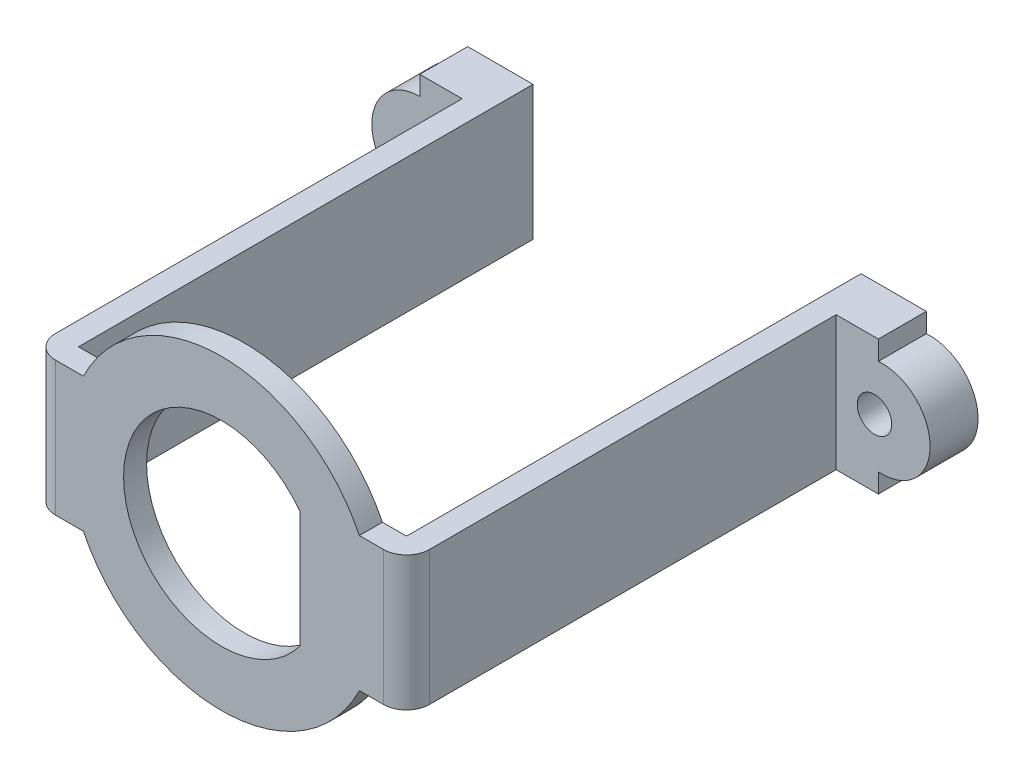
ISO-10303-21;
HEADER;
FILE_DESCRIPTION(('STEP AP214'),'2;1');
FILE_NAME('part.step','',(''),(''),'','','');
FILE_SCHEMA(('AUTOMOTIVE_DESIGN { 1 0 10303 214 1 1 1 1 }'));
ENDSEC;
DATA;
#1=APPLICATION_CONTEXT('core data for automotive mechanical design processes');
#2=APPLICATION_PROTOCOL_DEFINITION('international standard','automotive_design',2000,#1);
#3=PRODUCT_CONTEXT('',#1,'mechanical');
#4=PRODUCT('Part','Part','',(#3));
#5=PRODUCT_RELATED_PRODUCT_CATEGORY('part','',(#4));
#6=PRODUCT_DEFINITION_FORMATION('','',#4);
#7=PRODUCT_DEFINITION_CONTEXT('part definition',#1,'design');
#8=PRODUCT_DEFINITION('design','',#6,#7);
#9=PRODUCT_DEFINITION_SHAPE('','',#8);
#10=(LENGTH_UNIT() NAMED_UNIT(*) SI_UNIT(.MILLI.,.METRE.));
#11=(NAMED_UNIT(*) PLANE_ANGLE_UNIT() SI_UNIT($,.RADIAN.));
#12=(NAMED_UNIT(*) SI_UNIT($,.STERADIAN.) SOLID_ANGLE_UNIT());
#13=UNCERTAINTY_MEASURE_WITH_UNIT(LENGTH_MEASURE(1.E-05),#10,'distance_accuracy_value','');
#14=(GEOMETRIC_REPRESENTATION_CONTEXT(3) GLOBAL_UNCERTAINTY_ASSIGNED_CONTEXT((#13)) GLOBAL_UNIT_ASSIGNED_CONTEXT((#10,
#11,#12)) REPRESENTATION_CONTEXT('',''));
#15=CARTESIAN_POINT('',(0.,0.,0.));
#16=DIRECTION('',(0.,0.,1.));
#17=DIRECTION('',(1.,0.,0.));
#18=AXIS2_PLACEMENT_3D('',#15,#16,#17);
#19=CARTESIAN_POINT('',(11.8500000000001,-2.49198715887542,-21.2000000000001));
#20=DIRECTION('',(1.,0.,0.));
#21=DIRECTION('',(0.,0.,-1.));
#22=AXIS2_PLACEMENT_3D('',#19,#20,#21);
#23=PLANE('',#22);
#24=DIRECTION('',(0.,1.,0.));
#25=VECTOR('',#24,1.);
#26=CARTESIAN_POINT('',(11.8500000000001,0.,-21.2000000000001));
#27=LINE('',#26,#25);
#28=CARTESIAN_POINT('',(11.8500000000001,-2.49198715887542,-21.2000000000001));
#29=VERTEX_POINT('',#28);
#30=CARTESIAN_POINT('',(11.8500000000001,-3.5,-21.2000000000001));
#31=VERTEX_POINT('',#30);
#32=EDGE_CURVE('E181',#29,#31,#27,.F.);
#33=ORIENTED_EDGE('',*,*,#32,.T.);
#34=DIRECTION('',(0.,0.,1.));
#35=VECTOR('',#34,1.);
#36=CARTESIAN_POINT('',(11.8500000000001,-3.5,-23.7));
#37=LINE('',#36,#35);
#38=CARTESIAN_POINT('',(11.8500000000001,-3.5,-23.7));
#39=VERTEX_POINT('',#38);
#40=EDGE_CURVE('E214',#31,#39,#37,.F.);
#41=ORIENTED_EDGE('',*,*,#40,.T.);
#42=DIRECTION('',(0.,1.,0.));
#43=VECTOR('',#42,1.);
#44=CARTESIAN_POINT('',(11.8500000000001,-2.49198715887542,-23.7000000000001));
#45=LINE('',#44,#43);
#46=CARTESIAN_POINT('',(11.8500000000001,-2.49198715887542,-23.7000000000001));
#47=VERTEX_POINT('',#46);
#48=EDGE_CURVE('E183',#39,#47,#45,.T.);
#49=ORIENTED_EDGE('',*,*,#48,.T.);
#50=DIRECTION('',(0.,0.,-1.));
#51=VECTOR('',#50,1.);
#52=CARTESIAN_POINT('',(11.8500000000001,-2.49198715887542,-21.2000000000001));
#53=LINE('',#52,#51);
#54=EDGE_CURVE('E178',#29,#47,#53,.T.);
#55=ORIENTED_EDGE('',*,*,#54,.F.);
#56=EDGE_LOOP('',(#33,#41,#49,#55));
#57=FACE_BOUND('',#56,.T.);
#58=ADVANCED_FACE('F16',(#57),#23,.T.);
#59=CARTESIAN_POINT('',(11.6500000000001,0.,1.20100000000001));
#60=DIRECTION('',(0.,0.,-1.));
#61=DIRECTION('',(-1.,0.,0.));
#62=AXIS2_PLACEMENT_3D('',#59,#60,#61);
#63=CYLINDRICAL_SURFACE('',#62,0.900000000000128);
#64=CARTESIAN_POINT('',(11.6500000000001,0.,-21.2000000000001));
#65=DIRECTION('',(0.,0.,-1.));
#66=DIRECTION('',(-1.,0.,0.));
#67=AXIS2_PLACEMENT_3D('',#64,#65,#66);
#68=CIRCLE('',#67,0.900000000000128);
#69=CARTESIAN_POINT('',(10.7499999999999,0.,-21.2000000000001));
#70=VERTEX_POINT('',#69);
#71=EDGE_CURVE('E19',#70,#70,#68,.F.);
#72=ORIENTED_EDGE('',*,*,#71,.T.);
#73=EDGE_LOOP('',(#72));
#74=FACE_BOUND('',#73,.T.);
#75=CARTESIAN_POINT('',(11.65,0.,-23.7000000000001));
#76=DIRECTION('',(0.,0.,-1.));
#77=DIRECTION('',(-1.,0.,0.));
#78=AXIS2_PLACEMENT_3D('',#75,#76,#77);
#79=CIRCLE('',#78,0.900000000000128);
#80=CARTESIAN_POINT('',(10.7499999999999,0.,-23.7000000000001));
#81=VERTEX_POINT('',#80);
#82=EDGE_CURVE('E210',#81,#81,#79,.T.);
#83=ORIENTED_EDGE('',*,*,#82,.T.);
#84=EDGE_LOOP('',(#83));
#85=FACE_BOUND('',#84,.T.);
#86=ADVANCED_FACE('F734',(#74,#85),#63,.F.);
#87=CARTESIAN_POINT('',(12.0500000000001,0.,-21.2000000000001));
#88=DIRECTION('',(0.,0.,-1.));
#89=DIRECTION('',(-1.,0.,0.));
#90=AXIS2_PLACEMENT_3D('',#87,#88,#89);
#91=CYLINDRICAL_SURFACE('',#90,2.5);
#92=CARTESIAN_POINT('',(12.0500000000001,0.,-21.2000000000001));
#93=DIRECTION('',(0.,0.,-1.));
#94=DIRECTION('',(-1.,0.,0.));
#95=AXIS2_PLACEMENT_3D('',#92,#93,#94);
#96=CIRCLE('',#95,2.5);
#97=CARTESIAN_POINT('',(11.8500000000001,2.49198715887542,-21.2000000000001));
#98=VERTEX_POINT('',#97);
#99=EDGE_CURVE('E190',#98,#29,#96,.T.);
#100=ORIENTED_EDGE('',*,*,#99,.T.);
#101=ORIENTED_EDGE('',*,*,#54,.T.);
#102=CARTESIAN_POINT('',(12.0500000000001,0.,-23.7000000000001));
#103=DIRECTION('',(0.,0.,-1.));
#104=DIRECTION('',(-1.,0.,0.));
#105=AXIS2_PLACEMENT_3D('',#102,#103,#104);
#106=CIRCLE('',#105,2.5);
#107=CARTESIAN_POINT('',(11.8500000000001,2.49198715887542,-23.7));
#108=VERTEX_POINT('',#107);
#109=EDGE_CURVE('E215',#47,#108,#106,.F.);
#110=ORIENTED_EDGE('',*,*,#109,.T.);
#111=DIRECTION('',(0.,0.,-1.));
#112=VECTOR('',#111,1.);
#113=CARTESIAN_POINT('',(11.8500000000001,2.49198715887542,-21.2000000000001));
#114=LINE('',#113,#112);
#115=EDGE_CURVE('E173',#98,#108,#114,.T.);
#116=ORIENTED_EDGE('',*,*,#115,.F.);
#117=EDGE_LOOP('',(#100,#101,#110,#116));
#118=FACE_BOUND('',#117,.T.);
#119=ADVANCED_FACE('F196',(#118),#91,.T.);
#120=CARTESIAN_POINT('',(11.8500000000001,3.5,-21.2000000000001));
#121=DIRECTION('',(1.,0.,0.));
#122=DIRECTION('',(0.,0.,-1.));
#123=AXIS2_PLACEMENT_3D('',#120,#121,#122);
#124=PLANE('',#123);
#125=DIRECTION('',(0.,1.,0.));
#126=VECTOR('',#125,1.);
#127=CARTESIAN_POINT('',(11.8500000000001,0.,-21.2000000000001));
#128=LINE('',#127,#126);
#129=CARTESIAN_POINT('',(11.8500000000001,3.5,-21.2000000000001));
#130=VERTEX_POINT('',#129);
#131=EDGE_CURVE('E197',#130,#98,#128,.F.);
#132=ORIENTED_EDGE('',*,*,#131,.T.);
#133=ORIENTED_EDGE('',*,*,#115,.T.);
#134=DIRECTION('',(0.,1.,0.));
#135=VECTOR('',#134,1.);
#136=CARTESIAN_POINT('',(11.8500000000001,3.5,-23.7));
#137=LINE('',#136,#135);
#138=CARTESIAN_POINT('',(11.8500000000001,3.5,-23.7));
#139=VERTEX_POINT('',#138);
#140=EDGE_CURVE('E217',#108,#139,#137,.T.);
#141=ORIENTED_EDGE('',*,*,#140,.T.);
#142=DIRECTION('',(0.,0.,-1.));
#143=VECTOR('',#142,1.);
#144=CARTESIAN_POINT('',(11.8500000000001,3.5,0.));
#145=LINE('',#144,#143);
#146=EDGE_CURVE('E269',#139,#130,#145,.F.);
#147=ORIENTED_EDGE('',*,*,#146,.T.);
#148=EDGE_LOOP('',(#132,#133,#141,#147));
#149=FACE_BOUND('',#148,.T.);
#150=ADVANCED_FACE('F718',(#149),#124,.T.);
#151=CARTESIAN_POINT('',(12.0500000000001,0.,-21.2000000000001));
#152=DIRECTION('',(0.,0.,-1.));
#153=DIRECTION('',(-1.,0.,0.));
#154=AXIS2_PLACEMENT_3D('',#151,#152,#153);
#155=PLANE('',#154);
#156=DIRECTION('',(1.,0.,0.));
#157=VECTOR('',#156,1.);
#158=CARTESIAN_POINT('',(9.65000000000008,-3.5,-21.2000000000001));
#159=LINE('',#158,#157);
#160=CARTESIAN_POINT('',(9.65000000000003,-3.5,-21.2000000000001));
#161=VERTEX_POINT('',#160);
#162=EDGE_CURVE('E193',#161,#31,#159,.T.);
#163=ORIENTED_EDGE('',*,*,#162,.T.);
#164=ORIENTED_EDGE('',*,*,#32,.F.);
#165=ORIENTED_EDGE('',*,*,#99,.F.);
#166=ORIENTED_EDGE('',*,*,#131,.F.);
#167=DIRECTION('',(1.,0.,0.));
#168=VECTOR('',#167,1.);
#169=CARTESIAN_POINT('',(9.65,3.5,-21.2000000000001));
#170=LINE('',#169,#168);
#171=CARTESIAN_POINT('',(9.65000000000007,3.5,-21.2000000000001));
#172=VERTEX_POINT('',#171);
#173=EDGE_CURVE('E265',#130,#172,#170,.F.);
#174=ORIENTED_EDGE('',*,*,#173,.T.);
#175=DIRECTION('',(0.,1.,0.));
#176=VECTOR('',#175,1.);
#177=CARTESIAN_POINT('',(9.65000000000007,-3.5,-21.2000000000001));
#178=LINE('',#177,#176);
#179=EDGE_CURVE('E194',#161,#172,#178,.T.);
#180=ORIENTED_EDGE('',*,*,#179,.F.);
#181=EDGE_LOOP('',(#163,#164,#165,#166,#174,#180));
#182=FACE_BOUND('',#181,.T.);
#183=ORIENTED_EDGE('',*,*,#71,.F.);
#184=EDGE_LOOP('',(#183));
#185=FACE_BOUND('',#184,.T.);
#186=ADVANCED_FACE('F188',(#182,#185),#155,.F.);
#187=CARTESIAN_POINT('',(9.65,-3.5,0.));
#188=DIRECTION('',(1.,0.,0.));
#189=DIRECTION('',(0.,0.,-1.));
#190=AXIS2_PLACEMENT_3D('',#187,#188,#189);
#191=PLANE('',#190);
#192=DIRECTION('',(0.,0.,-1.));
#193=VECTOR('',#192,1.);
#194=CARTESIAN_POINT('',(9.65000000000007,3.5,0.));
#195=LINE('',#194,#193);
#196=CARTESIAN_POINT('',(9.65000000000004,3.5,0.));
#197=VERTEX_POINT('',#196);
#198=EDGE_CURVE('E268',#172,#197,#195,.F.);
#199=ORIENTED_EDGE('',*,*,#198,.T.);
#200=DIRECTION('',(0.,1.,0.));
#201=VECTOR('',#200,1.);
#202=CARTESIAN_POINT('',(9.65,3.5,0.));
#203=LINE('',#202,#201);
#204=CARTESIAN_POINT('',(9.65,-3.5,0.));
#205=VERTEX_POINT('',#204);
#206=EDGE_CURVE('E204',#205,#197,#203,.T.);
#207=ORIENTED_EDGE('',*,*,#206,.F.);
#208=DIRECTION('',(0.,0.,1.));
#209=VECTOR('',#208,1.);
#210=CARTESIAN_POINT('',(9.65,-3.5,-23.7));
#211=LINE('',#210,#209);
#212=EDGE_CURVE('E209',#205,#161,#211,.F.);
#213=ORIENTED_EDGE('',*,*,#212,.T.);
#214=ORIENTED_EDGE('',*,*,#179,.T.);
#215=EDGE_LOOP('',(#199,#207,#213,#214));
#216=FACE_BOUND('',#215,.T.);
#217=ADVANCED_FACE('F701',(#216),#191,.T.);
#218=CARTESIAN_POINT('',(8.45,3.5,0.));
#219=DIRECTION('',(0.,1.,0.));
#220=DIRECTION('',(0.,0.,1.));
#221=AXIS2_PLACEMENT_3D('',#218,#219,#220);
#222=CYLINDRICAL_SURFACE('',#221,1.2);
#223=CARTESIAN_POINT('',(8.45,-3.5,0.));
#224=DIRECTION('',(0.,1.,0.));
#225=DIRECTION('',(0.,0.,1.));
#226=AXIS2_PLACEMENT_3D('',#223,#224,#225);
#227=CIRCLE('',#226,1.2);
#228=CARTESIAN_POINT('',(8.45,-3.5,1.2));
#229=VERTEX_POINT('',#228);
#230=EDGE_CURVE('E202',#229,#205,#227,.T.);
#231=ORIENTED_EDGE('',*,*,#230,.T.);
#232=ORIENTED_EDGE('',*,*,#206,.T.);
#233=CARTESIAN_POINT('',(8.45,3.5,0.));
#234=DIRECTION('',(0.,1.,0.));
#235=DIRECTION('',(0.,0.,1.));
#236=AXIS2_PLACEMENT_3D('',#233,#234,#235);
#237=CIRCLE('',#236,1.2);
#238=CARTESIAN_POINT('',(8.45,3.5,1.2));
#239=VERTEX_POINT('',#238);
#240=EDGE_CURVE('E200',#197,#239,#237,.F.);
#241=ORIENTED_EDGE('',*,*,#240,.T.);
#242=DIRECTION('',(0.,1.,0.));
#243=VECTOR('',#242,1.);
#244=CARTESIAN_POINT('',(8.44999999999999,0.,1.2));
#245=LINE('',#244,#243);
#246=EDGE_CURVE('E274',#229,#239,#245,.T.);
#247=ORIENTED_EDGE('',*,*,#246,.F.);
#248=EDGE_LOOP('',(#231,#232,#241,#247));
#249=FACE_BOUND('',#248,.T.);
#250=ADVANCED_FACE('F693',(#249),#222,.T.);
#251=CARTESIAN_POINT('',(-8.65,-3.5,0.));
#252=DIRECTION('',(0.,-1.,0.));
#253=DIRECTION('',(1.,0.,0.));
#254=AXIS2_PLACEMENT_3D('',#251,#252,#253);
#255=CYLINDRICAL_SURFACE('',#254,1.2);
#256=CARTESIAN_POINT('',(-8.65,3.5,0.));
#257=DIRECTION('',(0.,-1.,0.));
#258=DIRECTION('',(1.,0.,0.));
#259=AXIS2_PLACEMENT_3D('',#256,#257,#258);
#260=CIRCLE('',#259,1.2);
#261=CARTESIAN_POINT('',(-8.65,3.5,1.2));
#262=VERTEX_POINT('',#261);
#263=CARTESIAN_POINT('',(-9.85,3.5,0.));
#264=VERTEX_POINT('',#263);
#265=EDGE_CURVE('E207',#262,#264,#260,.T.);
#266=ORIENTED_EDGE('',*,*,#265,.T.);
#267=DIRECTION('',(0.,1.,0.));
#268=VECTOR('',#267,1.);
#269=CARTESIAN_POINT('',(-9.85,3.5,0.));
#270=LINE('',#269,#268);
#271=CARTESIAN_POINT('',(-9.85000000000003,-3.5,0.));
#272=VERTEX_POINT('',#271);
#273=EDGE_CURVE('E284',#272,#264,#270,.T.);
#274=ORIENTED_EDGE('',*,*,#273,.F.);
#275=CARTESIAN_POINT('',(-8.65,-3.5,0.));
#276=DIRECTION('',(0.,-1.,0.));
#277=DIRECTION('',(1.,0.,0.));
#278=AXIS2_PLACEMENT_3D('',#275,#276,#277);
#279=CIRCLE('',#278,1.2);
#280=CARTESIAN_POINT('',(-8.65,-3.5,1.2));
#281=VERTEX_POINT('',#280);
#282=EDGE_CURVE('E205',#272,#281,#279,.F.);
#283=ORIENTED_EDGE('',*,*,#282,.T.);
#284=DIRECTION('',(0.,1.,0.));
#285=VECTOR('',#284,1.);
#286=CARTESIAN_POINT('',(-8.64999999999999,0.,1.2));
#287=LINE('',#286,#285);
#288=EDGE_CURVE('E324',#262,#281,#287,.F.);
#289=ORIENTED_EDGE('',*,*,#288,.F.);
#290=EDGE_LOOP('',(#266,#274,#283,#289));
#291=FACE_BOUND('',#290,.T.);
#292=ADVANCED_FACE('F493',(#291),#255,.T.);
#293=CARTESIAN_POINT('',(9.65000000000008,3.5,-23.7));
#294=DIRECTION('',(0.,0.,1.));
#295=DIRECTION('',(1.,0.,0.));
#296=AXIS2_PLACEMENT_3D('',#293,#294,#295);
#297=PLANE('',#296);
#298=DIRECTION('',(1.,0.,0.));
#299=VECTOR('',#298,1.);
#300=CARTESIAN_POINT('',(9.65,3.5,-23.7));
#301=LINE('',#300,#299);
#302=CARTESIAN_POINT('',(8.45000000000008,3.5,-23.7));
#303=VERTEX_POINT('',#302);
#304=EDGE_CURVE('E309',#303,#139,#301,.T.);
#305=ORIENTED_EDGE('',*,*,#304,.T.);
#306=ORIENTED_EDGE('',*,*,#140,.F.);
#307=ORIENTED_EDGE('',*,*,#109,.F.);
#308=ORIENTED_EDGE('',*,*,#48,.F.);
#309=DIRECTION('',(1.,0.,0.));
#310=VECTOR('',#309,1.);
#311=CARTESIAN_POINT('',(9.65000000000008,-3.5,-23.7));
#312=LINE('',#311,#310);
#313=CARTESIAN_POINT('',(8.45000000000008,-3.5,-23.7));
#314=VERTEX_POINT('',#313);
#315=EDGE_CURVE('E213',#314,#39,#312,.T.);
#316=ORIENTED_EDGE('',*,*,#315,.F.);
#317=DIRECTION('',(0.,1.,0.));
#318=VECTOR('',#317,1.);
#319=CARTESIAN_POINT('',(8.45000000000008,-3.5,-23.7));
#320=LINE('',#319,#318);
#321=EDGE_CURVE('E347',#314,#303,#320,.T.);
#322=ORIENTED_EDGE('',*,*,#321,.T.);
#323=EDGE_LOOP('',(#305,#306,#307,#308,#316,#322));
#324=FACE_BOUND('',#323,.T.);
#325=ORIENTED_EDGE('',*,*,#82,.F.);
#326=EDGE_LOOP('',(#325));
#327=FACE_BOUND('',#326,.T.);
#328=ADVANCED_FACE('F521',(#324,#327),#297,.F.);
#329=CARTESIAN_POINT('',(0.,0.,1.2));
#330=DIRECTION('',(0.,0.,1.));
#331=DIRECTION('',(1.,0.,0.));
#332=AXIS2_PLACEMENT_3D('',#329,#330,#331);
#333=PLANE('',#332);
#334=DIRECTION('',(0.,1.,0.));
#335=VECTOR('',#334,1.);
#336=CARTESIAN_POINT('',(4.1,3.03315017762062,1.2));
#337=LINE('',#336,#335);
#338=CARTESIAN_POINT('',(4.1,-3.03315017762062,1.2));
#339=VERTEX_POINT('',#338);
#340=CARTESIAN_POINT('',(4.1,3.03315017762062,1.2));
#341=VERTEX_POINT('',#340);
#342=EDGE_CURVE('E371',#339,#341,#337,.T.);
#343=ORIENTED_EDGE('',*,*,#342,.F.);
#344=CARTESIAN_POINT('',(0.,0.,1.2));
#345=DIRECTION('',(0.,0.,-1.));
#346=DIRECTION('',(-1.,0.,0.));
#347=AXIS2_PLACEMENT_3D('',#344,#345,#346);
#348=CIRCLE('',#347,5.1);
#349=EDGE_CURVE('E235',#339,#341,#348,.T.);
#350=ORIENTED_EDGE('',*,*,#349,.T.);
#351=EDGE_LOOP('',(#343,#350));
#352=FACE_BOUND('',#351,.T.);
#353=ORIENTED_EDGE('',*,*,#288,.T.);
#354=DIRECTION('',(-1.,0.,0.));
#355=VECTOR('',#354,1.);
#356=CARTESIAN_POINT('',(-7.19374728496908,-3.5,1.2));
#357=LINE('',#356,#355);
#358=CARTESIAN_POINT('',(-7.19374728496908,-3.5,1.2));
#359=VERTEX_POINT('',#358);
#360=EDGE_CURVE('E363',#281,#359,#357,.F.);
#361=ORIENTED_EDGE('',*,*,#360,.T.);
#362=CARTESIAN_POINT('',(0.,0.,1.2));
#363=DIRECTION('',(0.,0.,-1.));
#364=DIRECTION('',(-1.,0.,0.));
#365=AXIS2_PLACEMENT_3D('',#362,#363,#364);
#366=CIRCLE('',#365,8.);
#367=CARTESIAN_POINT('',(7.19374728496908,-3.5,1.2));
#368=VERTEX_POINT('',#367);
#369=EDGE_CURVE('E231',#368,#359,#366,.T.);
#370=ORIENTED_EDGE('',*,*,#369,.F.);
#371=DIRECTION('',(1.,0.,0.));
#372=VECTOR('',#371,1.);
#373=CARTESIAN_POINT('',(8.45,-3.5,1.2));
#374=LINE('',#373,#372);
#375=EDGE_CURVE('E287',#368,#229,#374,.T.);
#376=ORIENTED_EDGE('',*,*,#375,.T.);
#377=ORIENTED_EDGE('',*,*,#246,.T.);
#378=DIRECTION('',(1.,0.,0.));
#379=VECTOR('',#378,1.);
#380=CARTESIAN_POINT('',(8.45,3.5,1.2));
#381=LINE('',#380,#379);
#382=CARTESIAN_POINT('',(7.19374728496908,3.5,1.2));
#383=VERTEX_POINT('',#382);
#384=EDGE_CURVE('E230',#239,#383,#381,.F.);
#385=ORIENTED_EDGE('',*,*,#384,.T.);
#386=CARTESIAN_POINT('',(0.,0.,1.2));
#387=DIRECTION('',(0.,0.,-1.));
#388=DIRECTION('',(-1.,0.,0.));
#389=AXIS2_PLACEMENT_3D('',#386,#387,#388);
#390=CIRCLE('',#389,8.);
#391=CARTESIAN_POINT('',(-7.19374728496908,3.5,1.2));
#392=VERTEX_POINT('',#391);
#393=EDGE_CURVE('E227',#392,#383,#390,.T.);
#394=ORIENTED_EDGE('',*,*,#393,.F.);
#395=DIRECTION('',(1.,0.,0.));
#396=VECTOR('',#395,1.);
#397=CARTESIAN_POINT('',(-7.19374728496908,3.5,1.2));
#398=LINE('',#397,#396);
#399=EDGE_CURVE('E360',#392,#262,#398,.F.);
#400=ORIENTED_EDGE('',*,*,#399,.T.);
#401=EDGE_LOOP('',(#353,#361,#370,#376,#377,#385,#394,#400));
#402=FACE_BOUND('',#401,.T.);
#403=ADVANCED_FACE('F490',(#352,#402),#333,.T.);
#404=CARTESIAN_POINT('',(-12.0582444966471,2.49999999999986,-21.2));
#405=DIRECTION('',(-1.,0.,0.));
#406=DIRECTION('',(0.,-1.,0.));
#407=AXIS2_PLACEMENT_3D('',#404,#405,#406);
#408=PLANE('',#407);
#409=DIRECTION('',(0.,1.,0.));
#410=VECTOR('',#409,1.);
#411=CARTESIAN_POINT('',(-12.0582444966471,-1.35417478862422E-13,-21.2));
#412=LINE('',#411,#410);
#413=CARTESIAN_POINT('',(-12.0582444966471,2.49999999999986,-21.2));
#414=VERTEX_POINT('',#413);
#415=CARTESIAN_POINT('',(-12.0582444966471,3.50000000000001,-21.2));
#416=VERTEX_POINT('',#415);
#417=EDGE_CURVE('E221',#414,#416,#412,.T.);
#418=ORIENTED_EDGE('',*,*,#417,.T.);
#419=DIRECTION('',(0.,0.,1.));
#420=VECTOR('',#419,1.);
#421=CARTESIAN_POINT('',(-12.058244496647,3.5,-23.7));
#422=LINE('',#421,#420);
#423=CARTESIAN_POINT('',(-12.058244496647,3.5,-23.7));
#424=VERTEX_POINT('',#423);
#425=EDGE_CURVE('E244',#416,#424,#422,.F.);
#426=ORIENTED_EDGE('',*,*,#425,.T.);
#427=DIRECTION('',(0.,-1.,0.));
#428=VECTOR('',#427,1.);
#429=CARTESIAN_POINT('',(-12.0582444966471,2.49999999999986,-23.7));
#430=LINE('',#429,#428);
#431=CARTESIAN_POINT('',(-12.0582444966471,2.49999999999986,-23.7));
#432=VERTEX_POINT('',#431);
#433=EDGE_CURVE('E320',#424,#432,#430,.T.);
#434=ORIENTED_EDGE('',*,*,#433,.T.);
#435=DIRECTION('',(0.,0.,-1.));
#436=VECTOR('',#435,1.);
#437=CARTESIAN_POINT('',(-12.0582444966471,2.49999999999986,-21.2));
#438=LINE('',#437,#436);
#439=EDGE_CURVE('E323',#414,#432,#438,.T.);
#440=ORIENTED_EDGE('',*,*,#439,.F.);
#441=EDGE_LOOP('',(#418,#426,#434,#440));
#442=FACE_BOUND('',#441,.T.);
#443=ADVANCED_FACE('F510',(#442),#408,.T.);
#444=CARTESIAN_POINT('',(-11.6499999999999,0.,1.20100000000009));
#445=DIRECTION('',(0.,0.,-1.));
#446=DIRECTION('',(-1.,0.,0.));
#447=AXIS2_PLACEMENT_3D('',#444,#445,#446);
#448=CYLINDRICAL_SURFACE('',#447,0.900000000000125);
#449=CARTESIAN_POINT('',(-11.6499999999999,0.,-21.2));
#450=DIRECTION('',(0.,0.,-1.));
#451=DIRECTION('',(-1.,0.,0.));
#452=AXIS2_PLACEMENT_3D('',#449,#450,#451);
#453=CIRCLE('',#452,0.900000000000125);
#454=CARTESIAN_POINT('',(-12.5500000000001,0.,-21.2));
#455=VERTEX_POINT('',#454);
#456=EDGE_CURVE('E218',#455,#455,#453,.F.);
#457=ORIENTED_EDGE('',*,*,#456,.T.);
#458=EDGE_LOOP('',(#457));
#459=FACE_BOUND('',#458,.T.);
#460=CARTESIAN_POINT('',(-11.65,0.,-23.7));
#461=DIRECTION('',(0.,0.,-1.));
#462=DIRECTION('',(-1.,0.,0.));
#463=AXIS2_PLACEMENT_3D('',#460,#461,#462);
#464=CIRCLE('',#463,0.900000000000125);
#465=CARTESIAN_POINT('',(-12.5500000000001,0.,-23.7));
#466=VERTEX_POINT('',#465);
#467=EDGE_CURVE('E240',#466,#466,#464,.T.);
#468=ORIENTED_EDGE('',*,*,#467,.T.);
#469=EDGE_LOOP('',(#468));
#470=FACE_BOUND('',#469,.T.);
#471=ADVANCED_FACE('F512',(#459,#470),#448,.F.);
#472=CARTESIAN_POINT('',(-12.0582444966471,-1.35417478862422E-13,-21.2));
#473=DIRECTION('',(0.,0.,-1.));
#474=DIRECTION('',(-1.,0.,0.));
#475=AXIS2_PLACEMENT_3D('',#472,#473,#474);
#476=CYLINDRICAL_SURFACE('',#475,2.5);
#477=CARTESIAN_POINT('',(-12.0582444966471,-1.35417478862422E-13,-23.7));
#478=DIRECTION('',(0.,0.,-1.));
#479=DIRECTION('',(-1.,0.,0.));
#480=AXIS2_PLACEMENT_3D('',#477,#478,#479);
#481=CIRCLE('',#480,2.5);
#482=CARTESIAN_POINT('',(-12.0582444966471,-2.50000000000014,-23.7));
#483=VERTEX_POINT('',#482);
#484=EDGE_CURVE('E245',#432,#483,#481,.F.);
#485=ORIENTED_EDGE('',*,*,#484,.T.);
#486=DIRECTION('',(0.,0.,1.));
#487=VECTOR('',#486,1.);
#488=CARTESIAN_POINT('',(-12.0582444966471,-2.50000000000014,-21.2));
#489=LINE('',#488,#487);
#490=CARTESIAN_POINT('',(-12.0582444966471,-2.50000000000014,-21.2));
#491=VERTEX_POINT('',#490);
#492=EDGE_CURVE('E222',#491,#483,#489,.F.);
#493=ORIENTED_EDGE('',*,*,#492,.F.);
#494=CARTESIAN_POINT('',(-12.0582444966471,-1.35417478862422E-13,-21.2));
#495=DIRECTION('',(0.,0.,-1.));
#496=DIRECTION('',(-1.,0.,0.));
#497=AXIS2_PLACEMENT_3D('',#494,#495,#496);
#498=CIRCLE('',#497,2.5);
#499=EDGE_CURVE('E223',#491,#414,#498,.T.);
#500=ORIENTED_EDGE('',*,*,#499,.T.);
#501=ORIENTED_EDGE('',*,*,#439,.T.);
#502=EDGE_LOOP('',(#485,#493,#500,#501));
#503=FACE_BOUND('',#502,.T.);
#504=ADVANCED_FACE('F507',(#503),#476,.T.);
#505=CARTESIAN_POINT('',(-12.0582444966471,-3.49999999999998,-21.2));
#506=DIRECTION('',(-1.,0.,0.));
#507=DIRECTION('',(0.,0.,1.));
#508=AXIS2_PLACEMENT_3D('',#505,#506,#507);
#509=PLANE('',#508);
#510=DIRECTION('',(0.,1.,0.));
#511=VECTOR('',#510,1.);
#512=CARTESIAN_POINT('',(-12.0582444966471,-1.35417478862422E-13,-21.2));
#513=LINE('',#512,#511);
#514=CARTESIAN_POINT('',(-12.0582444966471,-3.5,-21.2));
#515=VERTEX_POINT('',#514);
#516=EDGE_CURVE('E226',#515,#491,#513,.T.);
#517=ORIENTED_EDGE('',*,*,#516,.T.);
#518=ORIENTED_EDGE('',*,*,#492,.T.);
#519=DIRECTION('',(0.,1.,0.));
#520=VECTOR('',#519,1.);
#521=CARTESIAN_POINT('',(-12.0582444966471,-3.5,-23.7));
#522=LINE('',#521,#520);
#523=CARTESIAN_POINT('',(-12.0582444966471,-3.49999999999998,-23.7));
#524=VERTEX_POINT('',#523);
#525=EDGE_CURVE('E248',#483,#524,#522,.F.);
#526=ORIENTED_EDGE('',*,*,#525,.T.);
#527=DIRECTION('',(0.,0.,1.));
#528=VECTOR('',#527,1.);
#529=CARTESIAN_POINT('',(-12.0582444966471,-3.5,0.));
#530=LINE('',#529,#528);
#531=EDGE_CURVE('E337',#524,#515,#530,.T.);
#532=ORIENTED_EDGE('',*,*,#531,.T.);
#533=EDGE_LOOP('',(#517,#518,#526,#532));
#534=FACE_BOUND('',#533,.T.);
#535=ADVANCED_FACE('F505',(#534),#509,.T.);
#536=CARTESIAN_POINT('',(-12.0582444966471,-1.35417478862422E-13,-21.2));
#537=DIRECTION('',(0.,0.,-1.));
#538=DIRECTION('',(-1.,0.,0.));
#539=AXIS2_PLACEMENT_3D('',#536,#537,#538);
#540=PLANE('',#539);
#541=ORIENTED_EDGE('',*,*,#516,.F.);
#542=DIRECTION('',(-1.,0.,0.));
#543=VECTOR('',#542,1.);
#544=CARTESIAN_POINT('',(-9.85,-3.5,-21.2));
#545=LINE('',#544,#543);
#546=CARTESIAN_POINT('',(-9.85000000000007,-3.5,-21.2));
#547=VERTEX_POINT('',#546);
#548=EDGE_CURVE('E280',#515,#547,#545,.F.);
#549=ORIENTED_EDGE('',*,*,#548,.T.);
#550=DIRECTION('',(0.,1.,0.));
#551=VECTOR('',#550,1.);
#552=CARTESIAN_POINT('',(-9.85000000000007,3.5,-21.2));
#553=LINE('',#552,#551);
#554=CARTESIAN_POINT('',(-9.85000000000005,3.5,-21.2));
#555=VERTEX_POINT('',#554);
#556=EDGE_CURVE('E225',#555,#547,#553,.F.);
#557=ORIENTED_EDGE('',*,*,#556,.F.);
#558=DIRECTION('',(1.,0.,0.));
#559=VECTOR('',#558,1.);
#560=CARTESIAN_POINT('',(-9.85000000000008,3.5,-21.2));
#561=LINE('',#560,#559);
#562=EDGE_CURVE('E283',#555,#416,#561,.F.);
#563=ORIENTED_EDGE('',*,*,#562,.T.);
#564=ORIENTED_EDGE('',*,*,#417,.F.);
#565=ORIENTED_EDGE('',*,*,#499,.F.);
#566=EDGE_LOOP('',(#541,#549,#557,#563,#564,#565));
#567=FACE_BOUND('',#566,.T.);
#568=ORIENTED_EDGE('',*,*,#456,.F.);
#569=EDGE_LOOP('',(#568));
#570=FACE_BOUND('',#569,.T.);
#571=ADVANCED_FACE('F499',(#567,#570),#540,.F.);
#572=CARTESIAN_POINT('',(-9.85,3.5,0.));
#573=DIRECTION('',(-1.,0.,0.));
#574=DIRECTION('',(0.,0.,1.));
#575=AXIS2_PLACEMENT_3D('',#572,#573,#574);
#576=PLANE('',#575);
#577=DIRECTION('',(0.,0.,1.));
#578=VECTOR('',#577,1.);
#579=CARTESIAN_POINT('',(-9.85000000000007,-3.5,0.));
#580=LINE('',#579,#578);
#581=EDGE_CURVE('E276',#547,#272,#580,.T.);
#582=ORIENTED_EDGE('',*,*,#581,.T.);
#583=ORIENTED_EDGE('',*,*,#273,.T.);
#584=DIRECTION('',(0.,0.,1.));
#585=VECTOR('',#584,1.);
#586=CARTESIAN_POINT('',(-9.85,3.5,-23.7));
#587=LINE('',#586,#585);
#588=EDGE_CURVE('E238',#264,#555,#587,.F.);
#589=ORIENTED_EDGE('',*,*,#588,.T.);
#590=ORIENTED_EDGE('',*,*,#556,.T.);
#591=EDGE_LOOP('',(#582,#583,#589,#590));
#592=FACE_BOUND('',#591,.T.);
#593=ADVANCED_FACE('F496',(#592),#576,.T.);
#594=CARTESIAN_POINT('',(8.45,-3.5,1.2));
#595=DIRECTION('',(0.,1.,0.));
#596=DIRECTION('',(0.,0.,1.));
#597=AXIS2_PLACEMENT_3D('',#594,#595,#596);
#598=PLANE('',#597);
#599=DIRECTION('',(1.,0.,0.));
#600=VECTOR('',#599,1.);
#601=CARTESIAN_POINT('',(0.,-3.5,0.));
#602=LINE('',#601,#600);
#603=CARTESIAN_POINT('',(7.19374728496908,-3.5,0.));
#604=VERTEX_POINT('',#603);
#605=CARTESIAN_POINT('',(8.45,-3.5,0.));
#606=VERTEX_POINT('',#605);
#607=EDGE_CURVE('E279',#604,#606,#602,.T.);
#608=ORIENTED_EDGE('',*,*,#607,.T.);
#609=DIRECTION('',(0.,0.,-1.));
#610=VECTOR('',#609,1.);
#611=CARTESIAN_POINT('',(8.45,-3.5,0.));
#612=LINE('',#611,#610);
#613=EDGE_CURVE('E351',#606,#314,#612,.T.);
#614=ORIENTED_EDGE('',*,*,#613,.T.);
#615=ORIENTED_EDGE('',*,*,#315,.T.);
#616=ORIENTED_EDGE('',*,*,#40,.F.);
#617=ORIENTED_EDGE('',*,*,#162,.F.);
#618=ORIENTED_EDGE('',*,*,#212,.F.);
#619=ORIENTED_EDGE('',*,*,#230,.F.);
#620=ORIENTED_EDGE('',*,*,#375,.F.);
#621=DIRECTION('',(0.,0.,-1.));
#622=VECTOR('',#621,1.);
#623=CARTESIAN_POINT('',(7.19374728496908,-3.5,1.2));
#624=LINE('',#623,#622);
#625=EDGE_CURVE('E234',#604,#368,#624,.F.);
#626=ORIENTED_EDGE('',*,*,#625,.F.);
#627=EDGE_LOOP('',(#608,#614,#615,#616,#617,#618,#619,#620,#626));
#628=FACE_BOUND('',#627,.T.);
#629=ADVANCED_FACE('F480',(#628),#598,.F.);
#630=CARTESIAN_POINT('',(8.45,-3.5,0.));
#631=DIRECTION('',(1.,0.,0.));
#632=DIRECTION('',(0.,0.,-1.));
#633=AXIS2_PLACEMENT_3D('',#630,#631,#632);
#634=PLANE('',#633);
#635=DIRECTION('',(0.,0.,-1.));
#636=VECTOR('',#635,1.);
#637=CARTESIAN_POINT('',(8.45,3.5,0.));
#638=LINE('',#637,#636);
#639=CARTESIAN_POINT('',(8.45,3.5,0.));
#640=VERTEX_POINT('',#639);
#641=EDGE_CURVE('E350',#303,#640,#638,.F.);
#642=ORIENTED_EDGE('',*,*,#641,.F.);
#643=ORIENTED_EDGE('',*,*,#321,.F.);
#644=ORIENTED_EDGE('',*,*,#613,.F.);
#645=DIRECTION('',(0.,1.,0.));
#646=VECTOR('',#645,1.);
#647=CARTESIAN_POINT('',(8.45,0.,0.));
#648=LINE('',#647,#646);
#649=EDGE_CURVE('E402',#606,#640,#648,.T.);
#650=ORIENTED_EDGE('',*,*,#649,.T.);
#651=EDGE_LOOP('',(#642,#643,#644,#650));
#652=FACE_BOUND('',#651,.T.);
#653=ADVANCED_FACE('F478',(#652),#634,.F.);
#654=CARTESIAN_POINT('',(8.45,3.5,1.2));
#655=DIRECTION('',(0.,-1.,0.));
#656=DIRECTION('',(1.,0.,0.));
#657=AXIS2_PLACEMENT_3D('',#654,#655,#656);
#658=PLANE('',#657);
#659=DIRECTION('',(0.,0.,-1.));
#660=VECTOR('',#659,1.);
#661=CARTESIAN_POINT('',(7.19374728496908,3.5,1.2));
#662=LINE('',#661,#660);
#663=CARTESIAN_POINT('',(7.19374728496908,3.5,0.));
#664=VERTEX_POINT('',#663);
#665=EDGE_CURVE('E229',#383,#664,#662,.T.);
#666=ORIENTED_EDGE('',*,*,#665,.F.);
#667=ORIENTED_EDGE('',*,*,#384,.F.);
#668=ORIENTED_EDGE('',*,*,#240,.F.);
#669=ORIENTED_EDGE('',*,*,#198,.F.);
#670=ORIENTED_EDGE('',*,*,#173,.F.);
#671=ORIENTED_EDGE('',*,*,#146,.F.);
#672=ORIENTED_EDGE('',*,*,#304,.F.);
#673=ORIENTED_EDGE('',*,*,#641,.T.);
#674=DIRECTION('',(1.,0.,0.));
#675=VECTOR('',#674,1.);
#676=CARTESIAN_POINT('',(0.,3.5,0.));
#677=LINE('',#676,#675);
#678=EDGE_CURVE('E253',#640,#664,#677,.F.);
#679=ORIENTED_EDGE('',*,*,#678,.T.);
#680=EDGE_LOOP('',(#666,#667,#668,#669,#670,#671,#672,#673,#679));
#681=FACE_BOUND('',#680,.T.);
#682=ADVANCED_FACE('F469',(#681),#658,.F.);
#683=CARTESIAN_POINT('',(0.,0.,1.2));
#684=DIRECTION('',(0.,0.,-1.));
#685=DIRECTION('',(-1.,0.,0.));
#686=AXIS2_PLACEMENT_3D('',#683,#684,#685);
#687=CYLINDRICAL_SURFACE('',#686,8.);
#688=ORIENTED_EDGE('',*,*,#393,.T.);
#689=ORIENTED_EDGE('',*,*,#665,.T.);
#690=CARTESIAN_POINT('',(0.,0.,0.));
#691=DIRECTION('',(0.,0.,-1.));
#692=DIRECTION('',(-1.,0.,0.));
#693=AXIS2_PLACEMENT_3D('',#690,#691,#692);
#694=CIRCLE('',#693,8.);
#695=CARTESIAN_POINT('',(-7.19374728496908,3.5,0.));
#696=VERTEX_POINT('',#695);
#697=EDGE_CURVE('E249',#664,#696,#694,.F.);
#698=ORIENTED_EDGE('',*,*,#697,.T.);
#699=DIRECTION('',(0.,0.,-1.));
#700=VECTOR('',#699,1.);
#701=CARTESIAN_POINT('',(-7.19374728496908,3.5,1.2));
#702=LINE('',#701,#700);
#703=EDGE_CURVE('E364',#696,#392,#702,.F.);
#704=ORIENTED_EDGE('',*,*,#703,.T.);
#705=EDGE_LOOP('',(#688,#689,#698,#704));
#706=FACE_BOUND('',#705,.T.);
#707=ADVANCED_FACE('F465',(#706),#687,.T.);
#708=CARTESIAN_POINT('',(0.,0.,1.2));
#709=DIRECTION('',(0.,0.,-1.));
#710=DIRECTION('',(-1.,0.,0.));
#711=AXIS2_PLACEMENT_3D('',#708,#709,#710);
#712=CYLINDRICAL_SURFACE('',#711,8.);
#713=ORIENTED_EDGE('',*,*,#369,.T.);
#714=DIRECTION('',(0.,0.,-1.));
#715=VECTOR('',#714,1.);
#716=CARTESIAN_POINT('',(-7.19374728496908,-3.5,1.2));
#717=LINE('',#716,#715);
#718=CARTESIAN_POINT('',(-7.19374728496908,-3.5,0.));
#719=VERTEX_POINT('',#718);
#720=EDGE_CURVE('E233',#359,#719,#717,.T.);
#721=ORIENTED_EDGE('',*,*,#720,.T.);
#722=CARTESIAN_POINT('',(0.,0.,0.));
#723=DIRECTION('',(0.,0.,-1.));
#724=DIRECTION('',(-1.,0.,0.));
#725=AXIS2_PLACEMENT_3D('',#722,#723,#724);
#726=CIRCLE('',#725,8.);
#727=EDGE_CURVE('E254',#719,#604,#726,.F.);
#728=ORIENTED_EDGE('',*,*,#727,.T.);
#729=ORIENTED_EDGE('',*,*,#625,.T.);
#730=EDGE_LOOP('',(#713,#721,#728,#729));
#731=FACE_BOUND('',#730,.T.);
#732=ADVANCED_FACE('F483',(#731),#712,.T.);
#733=CARTESIAN_POINT('',(4.1,3.03315017762062,1.2));
#734=DIRECTION('',(-1.,0.,0.));
#735=DIRECTION('',(0.,0.,1.));
#736=AXIS2_PLACEMENT_3D('',#733,#734,#735);
#737=PLANE('',#736);
#738=ORIENTED_EDGE('',*,*,#342,.T.);
#739=DIRECTION('',(0.,0.,-1.));
#740=VECTOR('',#739,1.);
#741=CARTESIAN_POINT('',(4.1,3.03315017762062,1.2));
#742=LINE('',#741,#740);
#743=CARTESIAN_POINT('',(4.1,3.03315017762062,0.));
#744=VERTEX_POINT('',#743);
#745=EDGE_CURVE('E239',#341,#744,#742,.T.);
#746=ORIENTED_EDGE('',*,*,#745,.T.);
#747=DIRECTION('',(0.,1.,0.));
#748=VECTOR('',#747,1.);
#749=CARTESIAN_POINT('',(4.1,0.,0.));
#750=LINE('',#749,#748);
#751=CARTESIAN_POINT('',(4.1,-3.03315017762062,0.));
#752=VERTEX_POINT('',#751);
#753=EDGE_CURVE('E257',#744,#752,#750,.F.);
#754=ORIENTED_EDGE('',*,*,#753,.T.);
#755=DIRECTION('',(0.,0.,-1.));
#756=VECTOR('',#755,1.);
#757=CARTESIAN_POINT('',(4.1,-3.03315017762062,1.2));
#758=LINE('',#757,#756);
#759=EDGE_CURVE('E373',#752,#339,#758,.F.);
#760=ORIENTED_EDGE('',*,*,#759,.T.);
#761=EDGE_LOOP('',(#738,#746,#754,#760));
#762=FACE_BOUND('',#761,.T.);
#763=ADVANCED_FACE('F541',(#762),#737,.T.);
#764=CARTESIAN_POINT('',(0.,0.,1.2));
#765=DIRECTION('',(0.,0.,-1.));
#766=DIRECTION('',(-1.,0.,0.));
#767=AXIS2_PLACEMENT_3D('',#764,#765,#766);
#768=CYLINDRICAL_SURFACE('',#767,5.1);
#769=ORIENTED_EDGE('',*,*,#349,.F.);
#770=ORIENTED_EDGE('',*,*,#759,.F.);
#771=CARTESIAN_POINT('',(0.,0.,0.));
#772=DIRECTION('',(0.,0.,-1.));
#773=DIRECTION('',(-1.,0.,0.));
#774=AXIS2_PLACEMENT_3D('',#771,#772,#773);
#775=CIRCLE('',#774,5.1);
#776=EDGE_CURVE('E259',#752,#744,#775,.T.);
#777=ORIENTED_EDGE('',*,*,#776,.T.);
#778=ORIENTED_EDGE('',*,*,#745,.F.);
#779=EDGE_LOOP('',(#769,#770,#777,#778));
#780=FACE_BOUND('',#779,.T.);
#781=ADVANCED_FACE('F538',(#780),#768,.F.);
#782=CARTESIAN_POINT('',(-9.85000000000008,3.5,-23.7));
#783=DIRECTION('',(0.,-1.,0.));
#784=DIRECTION('',(1.,0.,0.));
#785=AXIS2_PLACEMENT_3D('',#782,#783,#784);
#786=PLANE('',#785);
#787=DIRECTION('',(1.,0.,0.));
#788=VECTOR('',#787,1.);
#789=CARTESIAN_POINT('',(-9.85000000000008,3.5,-23.7));
#790=LINE('',#789,#788);
#791=CARTESIAN_POINT('',(-8.65000000000008,3.5,-23.7));
#792=VERTEX_POINT('',#791);
#793=EDGE_CURVE('E243',#792,#424,#790,.F.);
#794=ORIENTED_EDGE('',*,*,#793,.T.);
#795=ORIENTED_EDGE('',*,*,#425,.F.);
#796=ORIENTED_EDGE('',*,*,#562,.F.);
#797=ORIENTED_EDGE('',*,*,#588,.F.);
#798=ORIENTED_EDGE('',*,*,#265,.F.);
#799=ORIENTED_EDGE('',*,*,#399,.F.);
#800=ORIENTED_EDGE('',*,*,#703,.F.);
#801=DIRECTION('',(1.,0.,0.));
#802=VECTOR('',#801,1.);
#803=CARTESIAN_POINT('',(0.,3.5,0.));
#804=LINE('',#803,#802);
#805=CARTESIAN_POINT('',(-8.65,3.5,0.));
#806=VERTEX_POINT('',#805);
#807=EDGE_CURVE('E252',#696,#806,#804,.F.);
#808=ORIENTED_EDGE('',*,*,#807,.T.);
#809=DIRECTION('',(0.,0.,1.));
#810=VECTOR('',#809,1.);
#811=CARTESIAN_POINT('',(-8.65,3.5,0.));
#812=LINE('',#811,#810);
#813=EDGE_CURVE('E262',#806,#792,#812,.F.);
#814=ORIENTED_EDGE('',*,*,#813,.T.);
#815=EDGE_LOOP('',(#794,#795,#796,#797,#798,#799,#800,#808,#814));
#816=FACE_BOUND('',#815,.T.);
#817=ADVANCED_FACE('F455',(#816),#786,.F.);
#818=CARTESIAN_POINT('',(-9.85000000000008,-3.5,-23.7));
#819=DIRECTION('',(0.,0.,1.));
#820=DIRECTION('',(1.,0.,0.));
#821=AXIS2_PLACEMENT_3D('',#818,#819,#820);
#822=PLANE('',#821);
#823=DIRECTION('',(-1.,0.,0.));
#824=VECTOR('',#823,1.);
#825=CARTESIAN_POINT('',(-9.85,-3.5,-23.7));
#826=LINE('',#825,#824);
#827=CARTESIAN_POINT('',(-8.65000000000006,-3.49999999999999,-23.7));
#828=VERTEX_POINT('',#827);
#829=EDGE_CURVE('E34',#828,#524,#826,.T.);
#830=ORIENTED_EDGE('',*,*,#829,.T.);
#831=ORIENTED_EDGE('',*,*,#525,.F.);
#832=ORIENTED_EDGE('',*,*,#484,.F.);
#833=ORIENTED_EDGE('',*,*,#433,.F.);
#834=ORIENTED_EDGE('',*,*,#793,.F.);
#835=DIRECTION('',(0.,1.,0.));
#836=VECTOR('',#835,1.);
#837=CARTESIAN_POINT('',(-8.65000000000008,3.5,-23.7));
#838=LINE('',#837,#836);
#839=EDGE_CURVE('E409',#792,#828,#838,.F.);
#840=ORIENTED_EDGE('',*,*,#839,.T.);
#841=EDGE_LOOP('',(#830,#831,#832,#833,#834,#840));
#842=FACE_BOUND('',#841,.T.);
#843=ORIENTED_EDGE('',*,*,#467,.F.);
#844=EDGE_LOOP('',(#843));
#845=FACE_BOUND('',#844,.T.);
#846=ADVANCED_FACE('F447',(#842,#845),#822,.F.);
#847=CARTESIAN_POINT('',(-9.85,-3.5,0.));
#848=DIRECTION('',(0.,1.,0.));
#849=DIRECTION('',(-1.,0.,0.));
#850=AXIS2_PLACEMENT_3D('',#847,#848,#849);
#851=PLANE('',#850);
#852=DIRECTION('',(0.,0.,1.));
#853=VECTOR('',#852,1.);
#854=CARTESIAN_POINT('',(-8.65,-3.5,0.));
#855=LINE('',#854,#853);
#856=CARTESIAN_POINT('',(-8.65,-3.5,0.));
#857=VERTEX_POINT('',#856);
#858=EDGE_CURVE('E25',#828,#857,#855,.T.);
#859=ORIENTED_EDGE('',*,*,#858,.T.);
#860=DIRECTION('',(1.,0.,0.));
#861=VECTOR('',#860,1.);
#862=CARTESIAN_POINT('',(0.,-3.5,0.));
#863=LINE('',#862,#861);
#864=EDGE_CURVE('E258',#857,#719,#863,.T.);
#865=ORIENTED_EDGE('',*,*,#864,.T.);
#866=ORIENTED_EDGE('',*,*,#720,.F.);
#867=ORIENTED_EDGE('',*,*,#360,.F.);
#868=ORIENTED_EDGE('',*,*,#282,.F.);
#869=ORIENTED_EDGE('',*,*,#581,.F.);
#870=ORIENTED_EDGE('',*,*,#548,.F.);
#871=ORIENTED_EDGE('',*,*,#531,.F.);
#872=ORIENTED_EDGE('',*,*,#829,.F.);
#873=EDGE_LOOP('',(#859,#865,#866,#867,#868,#869,#870,#871,#872));
#874=FACE_BOUND('',#873,.T.);
#875=ADVANCED_FACE('F485',(#874),#851,.F.);
#876=CARTESIAN_POINT('',(0.,0.,0.));
#877=DIRECTION('',(0.,0.,1.));
#878=DIRECTION('',(1.,0.,0.));
#879=AXIS2_PLACEMENT_3D('',#876,#877,#878);
#880=PLANE('',#879);
#881=ORIENTED_EDGE('',*,*,#776,.F.);
#882=ORIENTED_EDGE('',*,*,#753,.F.);
#883=EDGE_LOOP('',(#881,#882));
#884=FACE_BOUND('',#883,.T.);
#885=ORIENTED_EDGE('',*,*,#864,.F.);
#886=DIRECTION('',(0.,1.,0.));
#887=VECTOR('',#886,1.);
#888=CARTESIAN_POINT('',(-8.65,3.5,0.));
#889=LINE('',#888,#887);
#890=EDGE_CURVE('E11',#857,#806,#889,.T.);
#891=ORIENTED_EDGE('',*,*,#890,.T.);
#892=ORIENTED_EDGE('',*,*,#807,.F.);
#893=ORIENTED_EDGE('',*,*,#697,.F.);
#894=ORIENTED_EDGE('',*,*,#678,.F.);
#895=ORIENTED_EDGE('',*,*,#649,.F.);
#896=ORIENTED_EDGE('',*,*,#607,.F.);
#897=ORIENTED_EDGE('',*,*,#727,.F.);
#898=EDGE_LOOP('',(#885,#891,#892,#893,#894,#895,#896,#897));
#899=FACE_BOUND('',#898,.T.);
#900=ADVANCED_FACE('F462',(#884,#899),#880,.F.);
#901=CARTESIAN_POINT('',(-8.65,3.5,0.));
#902=DIRECTION('',(-1.,0.,0.));
#903=DIRECTION('',(0.,0.,1.));
#904=AXIS2_PLACEMENT_3D('',#901,#902,#903);
#905=PLANE('',#904);
#906=ORIENTED_EDGE('',*,*,#858,.F.);
#907=ORIENTED_EDGE('',*,*,#839,.F.);
#908=ORIENTED_EDGE('',*,*,#813,.F.);
#909=ORIENTED_EDGE('',*,*,#890,.F.);
#910=EDGE_LOOP('',(#906,#907,#908,#909));
#911=FACE_BOUND('',#910,.T.);
#912=ADVANCED_FACE('F452',(#911),#905,.F.);
#913=CLOSED_SHELL('',(#58,#86,#119,#150,#186,#217,#250,#292,#328,#403,#443,#471,#504,#535,#571,
#593,#629,#653,#682,#707,#732,#763,#781,#817,#846,#875,#900,#912));
#914=MANIFOLD_SOLID_BREP('B1',#913);
#915=ADVANCED_BREP_SHAPE_REPRESENTATION('',(#18,#914),#14);
#916=SHAPE_DEFINITION_REPRESENTATION(#9,#915);
ENDSEC;
END-ISO-10303-21;
